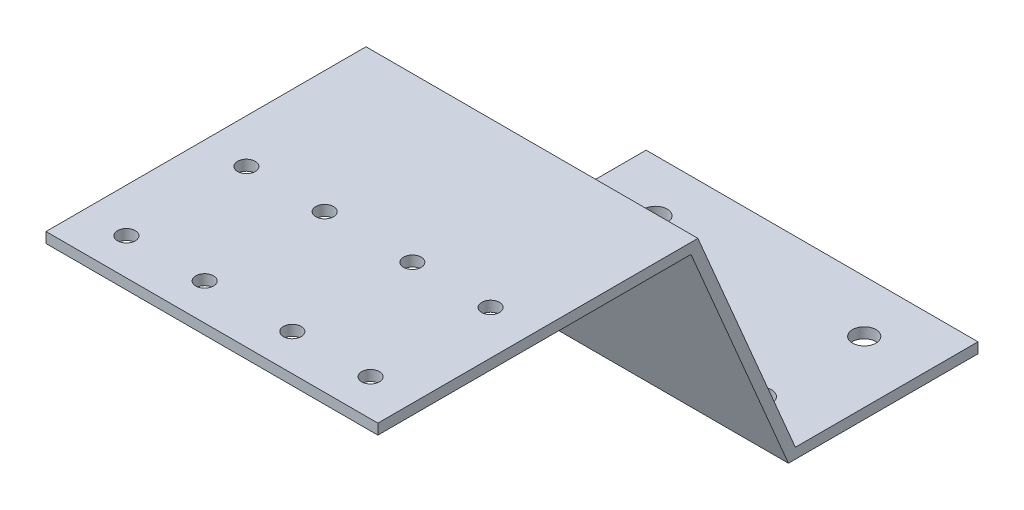
ISO-10303-21;
HEADER;
FILE_DESCRIPTION(('STEP AP214'),'2;1');
FILE_NAME('part.step','',(''),(''),'','','');
FILE_SCHEMA(('AUTOMOTIVE_DESIGN { 1 0 10303 214 1 1 1 1 }'));
ENDSEC;
DATA;
#1=APPLICATION_CONTEXT('core data for automotive mechanical design processes');
#2=APPLICATION_PROTOCOL_DEFINITION('international standard','automotive_design',2000,#1);
#3=PRODUCT_CONTEXT('',#1,'mechanical');
#4=PRODUCT('Part','Part','',(#3));
#5=PRODUCT_RELATED_PRODUCT_CATEGORY('part','',(#4));
#6=PRODUCT_DEFINITION_FORMATION('','',#4);
#7=PRODUCT_DEFINITION_CONTEXT('part definition',#1,'design');
#8=PRODUCT_DEFINITION('design','',#6,#7);
#9=PRODUCT_DEFINITION_SHAPE('','',#8);
#10=(LENGTH_UNIT() NAMED_UNIT(*) SI_UNIT(.MILLI.,.METRE.));
#11=(NAMED_UNIT(*) PLANE_ANGLE_UNIT() SI_UNIT($,.RADIAN.));
#12=(NAMED_UNIT(*) SI_UNIT($,.STERADIAN.) SOLID_ANGLE_UNIT());
#13=UNCERTAINTY_MEASURE_WITH_UNIT(LENGTH_MEASURE(1.E-05),#10,'distance_accuracy_value','');
#14=(GEOMETRIC_REPRESENTATION_CONTEXT(3) GLOBAL_UNCERTAINTY_ASSIGNED_CONTEXT((#13)) GLOBAL_UNIT_ASSIGNED_CONTEXT((#10,
#11,#12)) REPRESENTATION_CONTEXT('',''));
#15=CARTESIAN_POINT('',(0.,0.,0.));
#16=DIRECTION('',(0.,0.,1.));
#17=DIRECTION('',(1.,0.,0.));
#18=AXIS2_PLACEMENT_3D('',#15,#16,#17);
#19=CARTESIAN_POINT('',(31.8,0.,0.));
#20=DIRECTION('',(0.,1.,0.));
#21=DIRECTION('',(0.,0.,1.));
#22=AXIS2_PLACEMENT_3D('',#19,#20,#21);
#23=PLANE('',#22);
#24=CARTESIAN_POINT('',(-20.,0.,30.));
#25=DIRECTION('',(0.,1.,0.));
#26=DIRECTION('',(0.,0.,1.));
#27=AXIS2_PLACEMENT_3D('',#24,#25,#26);
#28=CIRCLE('',#27,2.25);
#29=CARTESIAN_POINT('',(-20.,0.,32.25));
#30=VERTEX_POINT('',#29);
#31=EDGE_CURVE('E246',#30,#30,#28,.T.);
#32=ORIENTED_EDGE('',*,*,#31,.T.);
#33=EDGE_LOOP('',(#32));
#34=FACE_BOUND('',#33,.T.);
#35=CARTESIAN_POINT('',(20.,0.,30.));
#36=DIRECTION('',(0.,1.,0.));
#37=DIRECTION('',(0.,0.,1.));
#38=AXIS2_PLACEMENT_3D('',#35,#36,#37);
#39=CIRCLE('',#38,2.25);
#40=CARTESIAN_POINT('',(20.,0.,32.25));
#41=VERTEX_POINT('',#40);
#42=EDGE_CURVE('E240',#41,#41,#39,.T.);
#43=ORIENTED_EDGE('',*,*,#42,.T.);
#44=EDGE_LOOP('',(#43));
#45=FACE_BOUND('',#44,.T.);
#46=CARTESIAN_POINT('',(20.,0.,10.));
#47=DIRECTION('',(0.,1.,0.));
#48=DIRECTION('',(0.,0.,1.));
#49=AXIS2_PLACEMENT_3D('',#46,#47,#48);
#50=CIRCLE('',#49,2.25);
#51=CARTESIAN_POINT('',(20.,0.,12.25));
#52=VERTEX_POINT('',#51);
#53=EDGE_CURVE('E234',#52,#52,#50,.T.);
#54=ORIENTED_EDGE('',*,*,#53,.T.);
#55=EDGE_LOOP('',(#54));
#56=FACE_BOUND('',#55,.T.);
#57=CARTESIAN_POINT('',(-20.,0.,10.));
#58=DIRECTION('',(0.,1.,0.));
#59=DIRECTION('',(0.,0.,1.));
#60=AXIS2_PLACEMENT_3D('',#57,#58,#59);
#61=CIRCLE('',#60,2.25);
#62=CARTESIAN_POINT('',(-20.,0.,12.25));
#63=VERTEX_POINT('',#62);
#64=EDGE_CURVE('E228',#63,#63,#61,.T.);
#65=ORIENTED_EDGE('',*,*,#64,.T.);
#66=EDGE_LOOP('',(#65));
#67=FACE_BOUND('',#66,.T.);
#68=DIRECTION('',(0.,0.,-1.));
#69=VECTOR('',#68,1.);
#70=CARTESIAN_POINT('',(-31.8,0.,0.));
#71=LINE('',#70,#69);
#72=CARTESIAN_POINT('',(-31.8,0.,36.3237900077245));
#73=VERTEX_POINT('',#72);
#74=CARTESIAN_POINT('',(-31.8,0.,0.));
#75=VERTEX_POINT('',#74);
#76=EDGE_CURVE('E133',#73,#75,#71,.T.);
#77=ORIENTED_EDGE('',*,*,#76,.T.);
#78=DIRECTION('',(-1.,0.,0.));
#79=VECTOR('',#78,1.);
#80=CARTESIAN_POINT('',(31.8,0.,0.));
#81=LINE('',#80,#79);
#82=CARTESIAN_POINT('',(31.8,0.,0.));
#83=VERTEX_POINT('',#82);
#84=EDGE_CURVE('E11',#83,#75,#81,.T.);
#85=ORIENTED_EDGE('',*,*,#84,.F.);
#86=DIRECTION('',(0.,0.,-1.));
#87=VECTOR('',#86,1.);
#88=CARTESIAN_POINT('',(31.8,0.,0.));
#89=LINE('',#88,#87);
#90=CARTESIAN_POINT('',(31.8,0.,36.3237900077245));
#91=VERTEX_POINT('',#90);
#92=EDGE_CURVE('E148',#91,#83,#89,.T.);
#93=ORIENTED_EDGE('',*,*,#92,.F.);
#94=DIRECTION('',(-1.,0.,0.));
#95=VECTOR('',#94,1.);
#96=CARTESIAN_POINT('',(31.8,0.,36.3237900077245));
#97=LINE('',#96,#95);
#98=EDGE_CURVE('E129',#91,#73,#97,.T.);
#99=ORIENTED_EDGE('',*,*,#98,.T.);
#100=EDGE_LOOP('',(#77,#85,#93,#99));
#101=FACE_BOUND('',#100,.T.);
#102=ADVANCED_FACE('F37',(#34,#45,#56,#67,#101),#23,.F.);
#103=CARTESIAN_POINT('',(31.8,0.,0.));
#104=DIRECTION('',(0.,0.,1.));
#105=DIRECTION('',(1.,0.,0.));
#106=AXIS2_PLACEMENT_3D('',#103,#104,#105);
#107=PLANE('',#106);
#108=DIRECTION('',(0.,1.,0.));
#109=VECTOR('',#108,1.);
#110=CARTESIAN_POINT('',(-31.8,0.,0.));
#111=LINE('',#110,#109);
#112=CARTESIAN_POINT('',(-31.8,2.,0.));
#113=VERTEX_POINT('',#112);
#114=EDGE_CURVE('E136',#75,#113,#111,.T.);
#115=ORIENTED_EDGE('',*,*,#114,.T.);
#116=DIRECTION('',(-1.,0.,0.));
#117=VECTOR('',#116,1.);
#118=CARTESIAN_POINT('',(31.8,2.,0.));
#119=LINE('',#118,#117);
#120=CARTESIAN_POINT('',(31.8,2.,0.));
#121=VERTEX_POINT('',#120);
#122=EDGE_CURVE('E45',#121,#113,#119,.T.);
#123=ORIENTED_EDGE('',*,*,#122,.F.);
#124=DIRECTION('',(0.,1.,0.));
#125=VECTOR('',#124,1.);
#126=CARTESIAN_POINT('',(31.8,0.,0.));
#127=LINE('',#126,#125);
#128=EDGE_CURVE('E96',#83,#121,#127,.T.);
#129=ORIENTED_EDGE('',*,*,#128,.F.);
#130=ORIENTED_EDGE('',*,*,#84,.T.);
#131=EDGE_LOOP('',(#115,#123,#129,#130));
#132=FACE_BOUND('',#131,.T.);
#133=ADVANCED_FACE('F258',(#132),#107,.F.);
#134=CARTESIAN_POINT('',(31.8,2.,0.));
#135=DIRECTION('',(0.,-1.,0.));
#136=DIRECTION('',(0.,0.,-1.));
#137=AXIS2_PLACEMENT_3D('',#134,#135,#136);
#138=PLANE('',#137);
#139=CARTESIAN_POINT('',(-20.,2.,30.));
#140=DIRECTION('',(0.,1.,0.));
#141=DIRECTION('',(0.,0.,1.));
#142=AXIS2_PLACEMENT_3D('',#139,#140,#141);
#143=CIRCLE('',#142,2.25);
#144=CARTESIAN_POINT('',(-20.,2.,32.25));
#145=VERTEX_POINT('',#144);
#146=EDGE_CURVE('E249',#145,#145,#143,.T.);
#147=ORIENTED_EDGE('',*,*,#146,.F.);
#148=EDGE_LOOP('',(#147));
#149=FACE_BOUND('',#148,.T.);
#150=CARTESIAN_POINT('',(20.,2.,30.));
#151=DIRECTION('',(0.,1.,0.));
#152=DIRECTION('',(0.,0.,1.));
#153=AXIS2_PLACEMENT_3D('',#150,#151,#152);
#154=CIRCLE('',#153,2.25);
#155=CARTESIAN_POINT('',(20.,2.,32.25));
#156=VERTEX_POINT('',#155);
#157=EDGE_CURVE('E243',#156,#156,#154,.T.);
#158=ORIENTED_EDGE('',*,*,#157,.F.);
#159=EDGE_LOOP('',(#158));
#160=FACE_BOUND('',#159,.T.);
#161=CARTESIAN_POINT('',(20.,2.,10.));
#162=DIRECTION('',(0.,1.,0.));
#163=DIRECTION('',(0.,0.,1.));
#164=AXIS2_PLACEMENT_3D('',#161,#162,#163);
#165=CIRCLE('',#164,2.25);
#166=CARTESIAN_POINT('',(20.,2.,12.25));
#167=VERTEX_POINT('',#166);
#168=EDGE_CURVE('E237',#167,#167,#165,.T.);
#169=ORIENTED_EDGE('',*,*,#168,.F.);
#170=EDGE_LOOP('',(#169));
#171=FACE_BOUND('',#170,.T.);
#172=CARTESIAN_POINT('',(-20.,2.,10.));
#173=DIRECTION('',(0.,1.,0.));
#174=DIRECTION('',(0.,0.,1.));
#175=AXIS2_PLACEMENT_3D('',#172,#173,#174);
#176=CIRCLE('',#175,2.25);
#177=CARTESIAN_POINT('',(-20.,2.,12.25));
#178=VERTEX_POINT('',#177);
#179=EDGE_CURVE('E231',#178,#178,#176,.T.);
#180=ORIENTED_EDGE('',*,*,#179,.F.);
#181=EDGE_LOOP('',(#180));
#182=FACE_BOUND('',#181,.T.);
#183=DIRECTION('',(0.,0.,1.));
#184=VECTOR('',#183,1.);
#185=CARTESIAN_POINT('',(-31.8,2.,0.));
#186=LINE('',#185,#184);
#187=CARTESIAN_POINT('',(-31.8,2.,35.));
#188=VERTEX_POINT('',#187);
#189=EDGE_CURVE('E139',#113,#188,#186,.T.);
#190=ORIENTED_EDGE('',*,*,#189,.T.);
#191=DIRECTION('',(-1.,0.,0.));
#192=VECTOR('',#191,1.);
#193=CARTESIAN_POINT('',(31.8,2.,35.));
#194=LINE('',#193,#192);
#195=CARTESIAN_POINT('',(31.8,2.,35.));
#196=VERTEX_POINT('',#195);
#197=EDGE_CURVE('E155',#196,#188,#194,.T.);
#198=ORIENTED_EDGE('',*,*,#197,.F.);
#199=DIRECTION('',(0.,0.,1.));
#200=VECTOR('',#199,1.);
#201=CARTESIAN_POINT('',(31.8,2.,0.));
#202=LINE('',#201,#200);
#203=EDGE_CURVE('E163',#121,#196,#202,.T.);
#204=ORIENTED_EDGE('',*,*,#203,.F.);
#205=ORIENTED_EDGE('',*,*,#122,.T.);
#206=EDGE_LOOP('',(#190,#198,#204,#205));
#207=FACE_BOUND('',#206,.T.);
#208=ADVANCED_FACE('F161',(#149,#160,#171,#182,#207),#138,.F.);
#209=CARTESIAN_POINT('',(31.8,2.,35.));
#210=DIRECTION('',(0.,-0.390719040244815,0.920509984514112));
#211=DIRECTION('',(0.,-0.920509984514112,-0.390719040244815));
#212=AXIS2_PLACEMENT_3D('',#209,#210,#211);
#213=PLANE('',#212);
#214=DIRECTION('',(0.,0.920509984514112,0.390719040244815));
#215=VECTOR('',#214,1.);
#216=CARTESIAN_POINT('',(-31.8,2.,35.));
#217=LINE('',#216,#215);
#218=CARTESIAN_POINT('',(-31.8,46.,53.6762099922755));
#219=VERTEX_POINT('',#218);
#220=EDGE_CURVE('E141',#188,#219,#217,.T.);
#221=ORIENTED_EDGE('',*,*,#220,.T.);
#222=DIRECTION('',(-1.,0.,0.));
#223=VECTOR('',#222,1.);
#224=CARTESIAN_POINT('',(31.8,46.,53.6762099922755));
#225=LINE('',#224,#223);
#226=CARTESIAN_POINT('',(31.8,46.,53.6762099922755));
#227=VERTEX_POINT('',#226);
#228=EDGE_CURVE('E152',#227,#219,#225,.T.);
#229=ORIENTED_EDGE('',*,*,#228,.F.);
#230=DIRECTION('',(0.,0.920509984514112,0.390719040244815));
#231=VECTOR('',#230,1.);
#232=CARTESIAN_POINT('',(31.8,2.,35.));
#233=LINE('',#232,#231);
#234=EDGE_CURVE('E175',#196,#227,#233,.T.);
#235=ORIENTED_EDGE('',*,*,#234,.F.);
#236=ORIENTED_EDGE('',*,*,#197,.T.);
#237=EDGE_LOOP('',(#221,#229,#235,#236));
#238=FACE_BOUND('',#237,.T.);
#239=ADVANCED_FACE('F171',(#238),#213,.F.);
#240=CARTESIAN_POINT('',(31.8,46.,53.6762099922755));
#241=DIRECTION('',(0.,-1.,0.));
#242=DIRECTION('',(0.,0.,-1.));
#243=AXIS2_PLACEMENT_3D('',#240,#241,#242);
#244=PLANE('',#243);
#245=CARTESIAN_POINT('',(-23.4,46.,108.));
#246=DIRECTION('',(0.,1.,0.));
#247=DIRECTION('',(0.,0.,1.));
#248=AXIS2_PLACEMENT_3D('',#245,#246,#247);
#249=CIRCLE('',#248,1.69999999999999);
#250=CARTESIAN_POINT('',(-23.4,46.,109.7));
#251=VERTEX_POINT('',#250);
#252=EDGE_CURVE('E225',#251,#251,#249,.T.);
#253=ORIENTED_EDGE('',*,*,#252,.F.);
#254=EDGE_LOOP('',(#253));
#255=FACE_BOUND('',#254,.T.);
#256=CARTESIAN_POINT('',(-23.4,46.,85.));
#257=DIRECTION('',(0.,1.,0.));
#258=DIRECTION('',(0.,0.,1.));
#259=AXIS2_PLACEMENT_3D('',#256,#257,#258);
#260=CIRCLE('',#259,1.69999999999999);
#261=CARTESIAN_POINT('',(-23.4,46.,86.7));
#262=VERTEX_POINT('',#261);
#263=EDGE_CURVE('E219',#262,#262,#260,.T.);
#264=ORIENTED_EDGE('',*,*,#263,.F.);
#265=EDGE_LOOP('',(#264));
#266=FACE_BOUND('',#265,.T.);
#267=CARTESIAN_POINT('',(-8.4,46.,85.));
#268=DIRECTION('',(0.,1.,0.));
#269=DIRECTION('',(0.,0.,1.));
#270=AXIS2_PLACEMENT_3D('',#267,#268,#269);
#271=CIRCLE('',#270,1.69999999999999);
#272=CARTESIAN_POINT('',(-8.4,46.,86.7));
#273=VERTEX_POINT('',#272);
#274=EDGE_CURVE('E213',#273,#273,#271,.T.);
#275=ORIENTED_EDGE('',*,*,#274,.F.);
#276=EDGE_LOOP('',(#275));
#277=FACE_BOUND('',#276,.T.);
#278=CARTESIAN_POINT('',(-8.4,46.,108.));
#279=DIRECTION('',(0.,1.,0.));
#280=DIRECTION('',(0.,0.,1.));
#281=AXIS2_PLACEMENT_3D('',#278,#279,#280);
#282=CIRCLE('',#281,1.69999999999999);
#283=CARTESIAN_POINT('',(-8.4,46.,109.7));
#284=VERTEX_POINT('',#283);
#285=EDGE_CURVE('E207',#284,#284,#282,.T.);
#286=ORIENTED_EDGE('',*,*,#285,.F.);
#287=EDGE_LOOP('',(#286));
#288=FACE_BOUND('',#287,.T.);
#289=CARTESIAN_POINT('',(23.4,46.,108.));
#290=DIRECTION('',(0.,1.,0.));
#291=DIRECTION('',(0.,0.,1.));
#292=AXIS2_PLACEMENT_3D('',#289,#290,#291);
#293=CIRCLE('',#292,1.69999999999999);
#294=CARTESIAN_POINT('',(23.4,46.,109.7));
#295=VERTEX_POINT('',#294);
#296=EDGE_CURVE('E201',#295,#295,#293,.T.);
#297=ORIENTED_EDGE('',*,*,#296,.F.);
#298=EDGE_LOOP('',(#297));
#299=FACE_BOUND('',#298,.T.);
#300=CARTESIAN_POINT('',(8.4,46.,108.));
#301=DIRECTION('',(0.,1.,0.));
#302=DIRECTION('',(0.,0.,1.));
#303=AXIS2_PLACEMENT_3D('',#300,#301,#302);
#304=CIRCLE('',#303,1.69999999999999);
#305=CARTESIAN_POINT('',(8.4,46.,109.7));
#306=VERTEX_POINT('',#305);
#307=EDGE_CURVE('E195',#306,#306,#304,.T.);
#308=ORIENTED_EDGE('',*,*,#307,.F.);
#309=EDGE_LOOP('',(#308));
#310=FACE_BOUND('',#309,.T.);
#311=CARTESIAN_POINT('',(8.4,46.,85.));
#312=DIRECTION('',(0.,1.,0.));
#313=DIRECTION('',(0.,0.,1.));
#314=AXIS2_PLACEMENT_3D('',#311,#312,#313);
#315=CIRCLE('',#314,1.69999999999999);
#316=CARTESIAN_POINT('',(8.4,46.,86.7));
#317=VERTEX_POINT('',#316);
#318=EDGE_CURVE('E189',#317,#317,#315,.T.);
#319=ORIENTED_EDGE('',*,*,#318,.F.);
#320=EDGE_LOOP('',(#319));
#321=FACE_BOUND('',#320,.T.);
#322=CARTESIAN_POINT('',(23.4,46.,85.));
#323=DIRECTION('',(0.,1.,0.));
#324=DIRECTION('',(0.,0.,1.));
#325=AXIS2_PLACEMENT_3D('',#322,#323,#324);
#326=CIRCLE('',#325,1.69999999999999);
#327=CARTESIAN_POINT('',(23.4,46.,86.7));
#328=VERTEX_POINT('',#327);
#329=EDGE_CURVE('E183',#328,#328,#326,.T.);
#330=ORIENTED_EDGE('',*,*,#329,.F.);
#331=EDGE_LOOP('',(#330));
#332=FACE_BOUND('',#331,.T.);
#333=DIRECTION('',(0.,0.,1.));
#334=VECTOR('',#333,1.);
#335=CARTESIAN_POINT('',(-31.8,46.,53.6762099922755));
#336=LINE('',#335,#334);
#337=CARTESIAN_POINT('',(-31.8,46.,115.));
#338=VERTEX_POINT('',#337);
#339=EDGE_CURVE('E143',#219,#338,#336,.T.);
#340=ORIENTED_EDGE('',*,*,#339,.T.);
#341=DIRECTION('',(-1.,0.,0.));
#342=VECTOR('',#341,1.);
#343=CARTESIAN_POINT('',(31.8,46.,115.));
#344=LINE('',#343,#342);
#345=CARTESIAN_POINT('',(31.8,46.,115.));
#346=VERTEX_POINT('',#345);
#347=EDGE_CURVE('E124',#346,#338,#344,.T.);
#348=ORIENTED_EDGE('',*,*,#347,.F.);
#349=DIRECTION('',(0.,0.,1.));
#350=VECTOR('',#349,1.);
#351=CARTESIAN_POINT('',(31.8,46.,53.6762099922755));
#352=LINE('',#351,#350);
#353=EDGE_CURVE('E115',#227,#346,#352,.T.);
#354=ORIENTED_EDGE('',*,*,#353,.F.);
#355=ORIENTED_EDGE('',*,*,#228,.T.);
#356=EDGE_LOOP('',(#340,#348,#354,#355));
#357=FACE_BOUND('',#356,.T.);
#358=ADVANCED_FACE('F174',(#255,#266,#277,#288,#299,#310,#321,#332,#357),#244,.F.);
#359=CARTESIAN_POINT('',(31.8,46.,115.));
#360=DIRECTION('',(0.,0.,-1.));
#361=DIRECTION('',(-1.,0.,0.));
#362=AXIS2_PLACEMENT_3D('',#359,#360,#361);
#363=PLANE('',#362);
#364=DIRECTION('',(0.,-1.,0.));
#365=VECTOR('',#364,1.);
#366=CARTESIAN_POINT('',(-31.8,46.,115.));
#367=LINE('',#366,#365);
#368=CARTESIAN_POINT('',(-31.8,44.,115.));
#369=VERTEX_POINT('',#368);
#370=EDGE_CURVE('E123',#338,#369,#367,.T.);
#371=ORIENTED_EDGE('',*,*,#370,.T.);
#372=DIRECTION('',(-1.,0.,0.));
#373=VECTOR('',#372,1.);
#374=CARTESIAN_POINT('',(31.8,44.,115.));
#375=LINE('',#374,#373);
#376=CARTESIAN_POINT('',(31.8,44.,115.));
#377=VERTEX_POINT('',#376);
#378=EDGE_CURVE('E120',#377,#369,#375,.T.);
#379=ORIENTED_EDGE('',*,*,#378,.F.);
#380=DIRECTION('',(0.,-1.,0.));
#381=VECTOR('',#380,1.);
#382=CARTESIAN_POINT('',(31.8,46.,115.));
#383=LINE('',#382,#381);
#384=EDGE_CURVE('E109',#346,#377,#383,.T.);
#385=ORIENTED_EDGE('',*,*,#384,.F.);
#386=ORIENTED_EDGE('',*,*,#347,.T.);
#387=EDGE_LOOP('',(#371,#379,#385,#386));
#388=FACE_BOUND('',#387,.T.);
#389=ADVANCED_FACE('F121',(#388),#363,.F.);
#390=CARTESIAN_POINT('',(31.8,44.,55.));
#391=DIRECTION('',(0.,1.,0.));
#392=DIRECTION('',(0.,0.,1.));
#393=AXIS2_PLACEMENT_3D('',#390,#391,#392);
#394=PLANE('',#393);
#395=CARTESIAN_POINT('',(-23.4,44.,108.));
#396=DIRECTION('',(0.,1.,0.));
#397=DIRECTION('',(0.,0.,1.));
#398=AXIS2_PLACEMENT_3D('',#395,#396,#397);
#399=CIRCLE('',#398,1.69999999999999);
#400=CARTESIAN_POINT('',(-23.4,44.,109.7));
#401=VERTEX_POINT('',#400);
#402=EDGE_CURVE('E222',#401,#401,#399,.T.);
#403=ORIENTED_EDGE('',*,*,#402,.T.);
#404=EDGE_LOOP('',(#403));
#405=FACE_BOUND('',#404,.T.);
#406=CARTESIAN_POINT('',(-23.4,44.,85.));
#407=DIRECTION('',(0.,1.,0.));
#408=DIRECTION('',(0.,0.,1.));
#409=AXIS2_PLACEMENT_3D('',#406,#407,#408);
#410=CIRCLE('',#409,1.69999999999999);
#411=CARTESIAN_POINT('',(-23.4,44.,86.7));
#412=VERTEX_POINT('',#411);
#413=EDGE_CURVE('E216',#412,#412,#410,.T.);
#414=ORIENTED_EDGE('',*,*,#413,.T.);
#415=EDGE_LOOP('',(#414));
#416=FACE_BOUND('',#415,.T.);
#417=CARTESIAN_POINT('',(-8.4,44.,85.));
#418=DIRECTION('',(0.,1.,0.));
#419=DIRECTION('',(0.,0.,1.));
#420=AXIS2_PLACEMENT_3D('',#417,#418,#419);
#421=CIRCLE('',#420,1.69999999999999);
#422=CARTESIAN_POINT('',(-8.4,44.,86.7));
#423=VERTEX_POINT('',#422);
#424=EDGE_CURVE('E210',#423,#423,#421,.T.);
#425=ORIENTED_EDGE('',*,*,#424,.T.);
#426=EDGE_LOOP('',(#425));
#427=FACE_BOUND('',#426,.T.);
#428=CARTESIAN_POINT('',(-8.4,44.,108.));
#429=DIRECTION('',(0.,1.,0.));
#430=DIRECTION('',(0.,0.,1.));
#431=AXIS2_PLACEMENT_3D('',#428,#429,#430);
#432=CIRCLE('',#431,1.69999999999999);
#433=CARTESIAN_POINT('',(-8.4,44.,109.7));
#434=VERTEX_POINT('',#433);
#435=EDGE_CURVE('E204',#434,#434,#432,.T.);
#436=ORIENTED_EDGE('',*,*,#435,.T.);
#437=EDGE_LOOP('',(#436));
#438=FACE_BOUND('',#437,.T.);
#439=CARTESIAN_POINT('',(23.4,44.,108.));
#440=DIRECTION('',(0.,1.,0.));
#441=DIRECTION('',(0.,0.,1.));
#442=AXIS2_PLACEMENT_3D('',#439,#440,#441);
#443=CIRCLE('',#442,1.69999999999999);
#444=CARTESIAN_POINT('',(23.4,44.,109.7));
#445=VERTEX_POINT('',#444);
#446=EDGE_CURVE('E198',#445,#445,#443,.T.);
#447=ORIENTED_EDGE('',*,*,#446,.T.);
#448=EDGE_LOOP('',(#447));
#449=FACE_BOUND('',#448,.T.);
#450=CARTESIAN_POINT('',(8.4,44.,108.));
#451=DIRECTION('',(0.,1.,0.));
#452=DIRECTION('',(0.,0.,1.));
#453=AXIS2_PLACEMENT_3D('',#450,#451,#452);
#454=CIRCLE('',#453,1.69999999999999);
#455=CARTESIAN_POINT('',(8.4,44.,109.7));
#456=VERTEX_POINT('',#455);
#457=EDGE_CURVE('E192',#456,#456,#454,.T.);
#458=ORIENTED_EDGE('',*,*,#457,.T.);
#459=EDGE_LOOP('',(#458));
#460=FACE_BOUND('',#459,.T.);
#461=CARTESIAN_POINT('',(8.4,44.,85.));
#462=DIRECTION('',(0.,1.,0.));
#463=DIRECTION('',(0.,0.,1.));
#464=AXIS2_PLACEMENT_3D('',#461,#462,#463);
#465=CIRCLE('',#464,1.69999999999999);
#466=CARTESIAN_POINT('',(8.4,44.,86.7));
#467=VERTEX_POINT('',#466);
#468=EDGE_CURVE('E186',#467,#467,#465,.T.);
#469=ORIENTED_EDGE('',*,*,#468,.T.);
#470=EDGE_LOOP('',(#469));
#471=FACE_BOUND('',#470,.T.);
#472=CARTESIAN_POINT('',(23.4,44.,85.));
#473=DIRECTION('',(0.,1.,0.));
#474=DIRECTION('',(0.,0.,1.));
#475=AXIS2_PLACEMENT_3D('',#472,#473,#474);
#476=CIRCLE('',#475,1.69999999999999);
#477=CARTESIAN_POINT('',(23.4,44.,86.7));
#478=VERTEX_POINT('',#477);
#479=EDGE_CURVE('E137',#478,#478,#476,.T.);
#480=ORIENTED_EDGE('',*,*,#479,.T.);
#481=EDGE_LOOP('',(#480));
#482=FACE_BOUND('',#481,.T.);
#483=DIRECTION('',(0.,0.,-1.));
#484=VECTOR('',#483,1.);
#485=CARTESIAN_POINT('',(-31.8,44.,55.));
#486=LINE('',#485,#484);
#487=CARTESIAN_POINT('',(-31.8,44.,55.));
#488=VERTEX_POINT('',#487);
#489=EDGE_CURVE('E82',#369,#488,#486,.T.);
#490=ORIENTED_EDGE('',*,*,#489,.T.);
#491=DIRECTION('',(-1.,0.,0.));
#492=VECTOR('',#491,1.);
#493=CARTESIAN_POINT('',(31.8,44.,55.));
#494=LINE('',#493,#492);
#495=CARTESIAN_POINT('',(31.8,44.,55.));
#496=VERTEX_POINT('',#495);
#497=EDGE_CURVE('E125',#496,#488,#494,.T.);
#498=ORIENTED_EDGE('',*,*,#497,.F.);
#499=DIRECTION('',(0.,0.,-1.));
#500=VECTOR('',#499,1.);
#501=CARTESIAN_POINT('',(31.8,44.,55.));
#502=LINE('',#501,#500);
#503=EDGE_CURVE('E113',#377,#496,#502,.T.);
#504=ORIENTED_EDGE('',*,*,#503,.F.);
#505=ORIENTED_EDGE('',*,*,#378,.T.);
#506=EDGE_LOOP('',(#490,#498,#504,#505));
#507=FACE_BOUND('',#506,.T.);
#508=ADVANCED_FACE('F127',(#405,#416,#427,#438,#449,#460,#471,#482,#507),#394,.F.);
#509=CARTESIAN_POINT('',(31.8,0.,36.3237900077245));
#510=DIRECTION('',(0.,0.390719040244815,-0.920509984514112));
#511=DIRECTION('',(0.,0.920509984514112,0.390719040244815));
#512=AXIS2_PLACEMENT_3D('',#509,#510,#511);
#513=PLANE('',#512);
#514=DIRECTION('',(0.,-0.920509984514112,-0.390719040244815));
#515=VECTOR('',#514,1.);
#516=CARTESIAN_POINT('',(-31.8,0.,36.3237900077245));
#517=LINE('',#516,#515);
#518=EDGE_CURVE('E88',#488,#73,#517,.T.);
#519=ORIENTED_EDGE('',*,*,#518,.T.);
#520=ORIENTED_EDGE('',*,*,#98,.F.);
#521=DIRECTION('',(0.,-0.920509984514112,-0.390719040244815));
#522=VECTOR('',#521,1.);
#523=CARTESIAN_POINT('',(31.8,0.,36.3237900077245));
#524=LINE('',#523,#522);
#525=EDGE_CURVE('E53',#496,#91,#524,.T.);
#526=ORIENTED_EDGE('',*,*,#525,.F.);
#527=ORIENTED_EDGE('',*,*,#497,.T.);
#528=EDGE_LOOP('',(#519,#520,#526,#527));
#529=FACE_BOUND('',#528,.T.);
#530=ADVANCED_FACE('F279',(#529),#513,.F.);
#531=CARTESIAN_POINT('',(31.8,0.,0.));
#532=DIRECTION('',(1.,0.,0.));
#533=DIRECTION('',(0.,0.,-1.));
#534=AXIS2_PLACEMENT_3D('',#531,#532,#533);
#535=PLANE('',#534);
#536=ORIENTED_EDGE('',*,*,#92,.T.);
#537=ORIENTED_EDGE('',*,*,#128,.T.);
#538=ORIENTED_EDGE('',*,*,#203,.T.);
#539=ORIENTED_EDGE('',*,*,#234,.T.);
#540=ORIENTED_EDGE('',*,*,#353,.T.);
#541=ORIENTED_EDGE('',*,*,#384,.T.);
#542=ORIENTED_EDGE('',*,*,#503,.T.);
#543=ORIENTED_EDGE('',*,*,#525,.T.);
#544=EDGE_LOOP('',(#536,#537,#538,#539,#540,#541,#542,#543));
#545=FACE_BOUND('',#544,.T.);
#546=ADVANCED_FACE('F111',(#545),#535,.T.);
#547=CARTESIAN_POINT('',(-31.8,0.,0.));
#548=DIRECTION('',(1.,0.,0.));
#549=DIRECTION('',(0.,0.,-1.));
#550=AXIS2_PLACEMENT_3D('',#547,#548,#549);
#551=PLANE('',#550);
#552=ORIENTED_EDGE('',*,*,#76,.F.);
#553=ORIENTED_EDGE('',*,*,#518,.F.);
#554=ORIENTED_EDGE('',*,*,#489,.F.);
#555=ORIENTED_EDGE('',*,*,#370,.F.);
#556=ORIENTED_EDGE('',*,*,#339,.F.);
#557=ORIENTED_EDGE('',*,*,#220,.F.);
#558=ORIENTED_EDGE('',*,*,#189,.F.);
#559=ORIENTED_EDGE('',*,*,#114,.F.);
#560=EDGE_LOOP('',(#552,#553,#554,#555,#556,#557,#558,#559));
#561=FACE_BOUND('',#560,.T.);
#562=ADVANCED_FACE('F167',(#561),#551,.F.);
#563=CARTESIAN_POINT('',(23.4,46.,85.));
#564=DIRECTION('',(0.,1.,0.));
#565=DIRECTION('',(0.,0.,1.));
#566=AXIS2_PLACEMENT_3D('',#563,#564,#565);
#567=CYLINDRICAL_SURFACE('',#566,1.69999999999999);
#568=ORIENTED_EDGE('',*,*,#329,.T.);
#569=EDGE_LOOP('',(#568));
#570=FACE_BOUND('',#569,.T.);
#571=ORIENTED_EDGE('',*,*,#479,.F.);
#572=EDGE_LOOP('',(#571));
#573=FACE_BOUND('',#572,.T.);
#574=ADVANCED_FACE('F330',(#570,#573),#567,.F.);
#575=CARTESIAN_POINT('',(8.4,46.,85.));
#576=DIRECTION('',(0.,1.,0.));
#577=DIRECTION('',(0.,0.,1.));
#578=AXIS2_PLACEMENT_3D('',#575,#576,#577);
#579=CYLINDRICAL_SURFACE('',#578,1.69999999999999);
#580=ORIENTED_EDGE('',*,*,#318,.T.);
#581=EDGE_LOOP('',(#580));
#582=FACE_BOUND('',#581,.T.);
#583=ORIENTED_EDGE('',*,*,#468,.F.);
#584=EDGE_LOOP('',(#583));
#585=FACE_BOUND('',#584,.T.);
#586=ADVANCED_FACE('F335',(#582,#585),#579,.F.);
#587=CARTESIAN_POINT('',(8.4,46.,108.));
#588=DIRECTION('',(0.,1.,0.));
#589=DIRECTION('',(0.,0.,1.));
#590=AXIS2_PLACEMENT_3D('',#587,#588,#589);
#591=CYLINDRICAL_SURFACE('',#590,1.69999999999999);
#592=ORIENTED_EDGE('',*,*,#307,.T.);
#593=EDGE_LOOP('',(#592));
#594=FACE_BOUND('',#593,.T.);
#595=ORIENTED_EDGE('',*,*,#457,.F.);
#596=EDGE_LOOP('',(#595));
#597=FACE_BOUND('',#596,.T.);
#598=ADVANCED_FACE('F347',(#594,#597),#591,.F.);
#599=CARTESIAN_POINT('',(23.4,46.,108.));
#600=DIRECTION('',(0.,1.,0.));
#601=DIRECTION('',(0.,0.,1.));
#602=AXIS2_PLACEMENT_3D('',#599,#600,#601);
#603=CYLINDRICAL_SURFACE('',#602,1.69999999999999);
#604=ORIENTED_EDGE('',*,*,#296,.T.);
#605=EDGE_LOOP('',(#604));
#606=FACE_BOUND('',#605,.T.);
#607=ORIENTED_EDGE('',*,*,#446,.F.);
#608=EDGE_LOOP('',(#607));
#609=FACE_BOUND('',#608,.T.);
#610=ADVANCED_FACE('F357',(#606,#609),#603,.F.);
#611=CARTESIAN_POINT('',(-8.4,46.,108.));
#612=DIRECTION('',(0.,1.,0.));
#613=DIRECTION('',(0.,0.,1.));
#614=AXIS2_PLACEMENT_3D('',#611,#612,#613);
#615=CYLINDRICAL_SURFACE('',#614,1.69999999999999);
#616=ORIENTED_EDGE('',*,*,#285,.T.);
#617=EDGE_LOOP('',(#616));
#618=FACE_BOUND('',#617,.T.);
#619=ORIENTED_EDGE('',*,*,#435,.F.);
#620=EDGE_LOOP('',(#619));
#621=FACE_BOUND('',#620,.T.);
#622=ADVANCED_FACE('F367',(#618,#621),#615,.F.);
#623=CARTESIAN_POINT('',(-8.4,46.,85.));
#624=DIRECTION('',(0.,1.,0.));
#625=DIRECTION('',(0.,0.,1.));
#626=AXIS2_PLACEMENT_3D('',#623,#624,#625);
#627=CYLINDRICAL_SURFACE('',#626,1.69999999999999);
#628=ORIENTED_EDGE('',*,*,#274,.T.);
#629=EDGE_LOOP('',(#628));
#630=FACE_BOUND('',#629,.T.);
#631=ORIENTED_EDGE('',*,*,#424,.F.);
#632=EDGE_LOOP('',(#631));
#633=FACE_BOUND('',#632,.T.);
#634=ADVANCED_FACE('F377',(#630,#633),#627,.F.);
#635=CARTESIAN_POINT('',(-23.4,46.,85.));
#636=DIRECTION('',(0.,1.,0.));
#637=DIRECTION('',(0.,0.,1.));
#638=AXIS2_PLACEMENT_3D('',#635,#636,#637);
#639=CYLINDRICAL_SURFACE('',#638,1.69999999999999);
#640=ORIENTED_EDGE('',*,*,#263,.T.);
#641=EDGE_LOOP('',(#640));
#642=FACE_BOUND('',#641,.T.);
#643=ORIENTED_EDGE('',*,*,#413,.F.);
#644=EDGE_LOOP('',(#643));
#645=FACE_BOUND('',#644,.T.);
#646=ADVANCED_FACE('F387',(#642,#645),#639,.F.);
#647=CARTESIAN_POINT('',(-23.4,46.,108.));
#648=DIRECTION('',(0.,1.,0.));
#649=DIRECTION('',(0.,0.,1.));
#650=AXIS2_PLACEMENT_3D('',#647,#648,#649);
#651=CYLINDRICAL_SURFACE('',#650,1.69999999999999);
#652=ORIENTED_EDGE('',*,*,#252,.T.);
#653=EDGE_LOOP('',(#652));
#654=FACE_BOUND('',#653,.T.);
#655=ORIENTED_EDGE('',*,*,#402,.F.);
#656=EDGE_LOOP('',(#655));
#657=FACE_BOUND('',#656,.T.);
#658=ADVANCED_FACE('F270',(#654,#657),#651,.F.);
#659=CARTESIAN_POINT('',(-20.,2.,10.));
#660=DIRECTION('',(0.,1.,0.));
#661=DIRECTION('',(0.,0.,1.));
#662=AXIS2_PLACEMENT_3D('',#659,#660,#661);
#663=CYLINDRICAL_SURFACE('',#662,2.25);
#664=ORIENTED_EDGE('',*,*,#179,.T.);
#665=EDGE_LOOP('',(#664));
#666=FACE_BOUND('',#665,.T.);
#667=ORIENTED_EDGE('',*,*,#64,.F.);
#668=EDGE_LOOP('',(#667));
#669=FACE_BOUND('',#668,.T.);
#670=ADVANCED_FACE('F266',(#666,#669),#663,.F.);
#671=CARTESIAN_POINT('',(20.,2.,10.));
#672=DIRECTION('',(0.,1.,0.));
#673=DIRECTION('',(0.,0.,1.));
#674=AXIS2_PLACEMENT_3D('',#671,#672,#673);
#675=CYLINDRICAL_SURFACE('',#674,2.25);
#676=ORIENTED_EDGE('',*,*,#168,.T.);
#677=EDGE_LOOP('',(#676));
#678=FACE_BOUND('',#677,.T.);
#679=ORIENTED_EDGE('',*,*,#53,.F.);
#680=EDGE_LOOP('',(#679));
#681=FACE_BOUND('',#680,.T.);
#682=ADVANCED_FACE('F269',(#678,#681),#675,.F.);
#683=CARTESIAN_POINT('',(20.,2.,30.));
#684=DIRECTION('',(0.,1.,0.));
#685=DIRECTION('',(0.,0.,1.));
#686=AXIS2_PLACEMENT_3D('',#683,#684,#685);
#687=CYLINDRICAL_SURFACE('',#686,2.25);
#688=ORIENTED_EDGE('',*,*,#157,.T.);
#689=EDGE_LOOP('',(#688));
#690=FACE_BOUND('',#689,.T.);
#691=ORIENTED_EDGE('',*,*,#42,.F.);
#692=EDGE_LOOP('',(#691));
#693=FACE_BOUND('',#692,.T.);
#694=ADVANCED_FACE('F431',(#690,#693),#687,.F.);
#695=CARTESIAN_POINT('',(-20.,2.,30.));
#696=DIRECTION('',(0.,1.,0.));
#697=DIRECTION('',(0.,0.,1.));
#698=AXIS2_PLACEMENT_3D('',#695,#696,#697);
#699=CYLINDRICAL_SURFACE('',#698,2.25);
#700=ORIENTED_EDGE('',*,*,#146,.T.);
#701=EDGE_LOOP('',(#700));
#702=FACE_BOUND('',#701,.T.);
#703=ORIENTED_EDGE('',*,*,#31,.F.);
#704=EDGE_LOOP('',(#703));
#705=FACE_BOUND('',#704,.T.);
#706=ADVANCED_FACE('F253',(#702,#705),#699,.F.);
#707=CLOSED_SHELL('',(#102,#133,#208,#239,#358,#389,#508,#530,#546,#562,#574,#586,#598,#610,
#622,#634,#646,#658,#670,#682,#694,#706));
#708=MANIFOLD_SOLID_BREP('B2',#707);
#709=ADVANCED_BREP_SHAPE_REPRESENTATION('',(#18,#708),#14);
#710=SHAPE_DEFINITION_REPRESENTATION(#9,#709);
ENDSEC;
END-ISO-10303-21;
